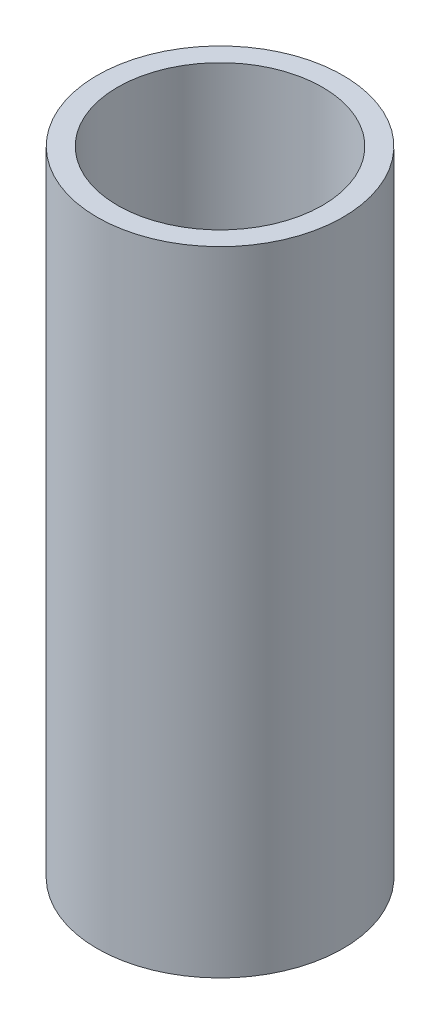
ISO-10303-21;
HEADER;
FILE_DESCRIPTION(('STEP AP214'),'2;1');
FILE_NAME('part.step','',(''),(''),'','','');
FILE_SCHEMA(('AUTOMOTIVE_DESIGN { 1 0 10303 214 1 1 1 1 }'));
ENDSEC;
DATA;
#1=APPLICATION_CONTEXT('core data for automotive mechanical design processes');
#2=APPLICATION_PROTOCOL_DEFINITION('international standard','automotive_design',2000,#1);
#3=PRODUCT_CONTEXT('',#1,'mechanical');
#4=PRODUCT('Part','Part','',(#3));
#5=PRODUCT_RELATED_PRODUCT_CATEGORY('part','',(#4));
#6=PRODUCT_DEFINITION_FORMATION('','',#4);
#7=PRODUCT_DEFINITION_CONTEXT('part definition',#1,'design');
#8=PRODUCT_DEFINITION('design','',#6,#7);
#9=PRODUCT_DEFINITION_SHAPE('','',#8);
#10=(LENGTH_UNIT() NAMED_UNIT(*) SI_UNIT(.MILLI.,.METRE.));
#11=(NAMED_UNIT(*) PLANE_ANGLE_UNIT() SI_UNIT($,.RADIAN.));
#12=(NAMED_UNIT(*) SI_UNIT($,.STERADIAN.) SOLID_ANGLE_UNIT());
#13=UNCERTAINTY_MEASURE_WITH_UNIT(LENGTH_MEASURE(1.E-05),#10,'distance_accuracy_value','');
#14=(GEOMETRIC_REPRESENTATION_CONTEXT(3) GLOBAL_UNCERTAINTY_ASSIGNED_CONTEXT((#13)) GLOBAL_UNIT_ASSIGNED_CONTEXT((#10,
#11,#12)) REPRESENTATION_CONTEXT('',''));
#15=CARTESIAN_POINT('',(0.,0.,0.));
#16=DIRECTION('',(0.,0.,1.));
#17=DIRECTION('',(1.,0.,0.));
#18=AXIS2_PLACEMENT_3D('',#15,#16,#17);
#19=CARTESIAN_POINT('',(0.,5.024,0.));
#20=DIRECTION('',(0.,1.,0.));
#21=DIRECTION('',(0.,0.,1.));
#22=AXIS2_PLACEMENT_3D('',#19,#20,#21);
#23=PLANE('',#22);
#24=CARTESIAN_POINT('',(0.,5.024,0.));
#25=DIRECTION('',(0.,1.,0.));
#26=DIRECTION('',(0.,0.,1.));
#27=AXIS2_PLACEMENT_3D('',#24,#25,#26);
#28=CIRCLE('',#27,1.95);
#29=CARTESIAN_POINT('',(0.,5.024,1.95));
#30=VERTEX_POINT('',#29);
#31=EDGE_CURVE('E10',#30,#30,#28,.T.);
#32=ORIENTED_EDGE('',*,*,#31,.T.);
#33=EDGE_LOOP('',(#32));
#34=FACE_BOUND('',#33,.T.);
#35=CARTESIAN_POINT('',(0.,5.024,0.));
#36=DIRECTION('',(0.,1.,0.));
#37=DIRECTION('',(0.,0.,1.));
#38=AXIS2_PLACEMENT_3D('',#35,#36,#37);
#39=CIRCLE('',#38,1.625);
#40=CARTESIAN_POINT('',(0.,5.024,1.625));
#41=VERTEX_POINT('',#40);
#42=EDGE_CURVE('E56',#41,#41,#39,.T.);
#43=ORIENTED_EDGE('',*,*,#42,.F.);
#44=EDGE_LOOP('',(#43));
#45=FACE_BOUND('',#44,.T.);
#46=ADVANCED_FACE('F43',(#34,#45),#23,.T.);
#47=CARTESIAN_POINT('',(0.,-5.024,0.));
#48=DIRECTION('',(0.,1.,0.));
#49=DIRECTION('',(0.,0.,1.));
#50=AXIS2_PLACEMENT_3D('',#47,#48,#49);
#51=PLANE('',#50);
#52=CARTESIAN_POINT('',(0.,-5.024,0.));
#53=DIRECTION('',(0.,1.,0.));
#54=DIRECTION('',(0.,0.,1.));
#55=AXIS2_PLACEMENT_3D('',#52,#53,#54);
#56=CIRCLE('',#55,1.95);
#57=CARTESIAN_POINT('',(0.,-5.024,1.95));
#58=VERTEX_POINT('',#57);
#59=EDGE_CURVE('E47',#58,#58,#56,.T.);
#60=ORIENTED_EDGE('',*,*,#59,.F.);
#61=EDGE_LOOP('',(#60));
#62=FACE_BOUND('',#61,.T.);
#63=CARTESIAN_POINT('',(0.,-5.024,0.));
#64=DIRECTION('',(0.,1.,0.));
#65=DIRECTION('',(0.,0.,1.));
#66=AXIS2_PLACEMENT_3D('',#63,#64,#65);
#67=CIRCLE('',#66,1.625);
#68=CARTESIAN_POINT('',(0.,-5.024,1.625));
#69=VERTEX_POINT('',#68);
#70=EDGE_CURVE('E58',#69,#69,#67,.T.);
#71=ORIENTED_EDGE('',*,*,#70,.T.);
#72=EDGE_LOOP('',(#71));
#73=FACE_BOUND('',#72,.T.);
#74=ADVANCED_FACE('F70',(#62,#73),#51,.F.);
#75=CARTESIAN_POINT('',(0.,5.024,0.));
#76=DIRECTION('',(0.,-1.,0.));
#77=DIRECTION('',(0.,0.,-1.));
#78=AXIS2_PLACEMENT_3D('',#75,#76,#77);
#79=CYLINDRICAL_SURFACE('',#78,1.95);
#80=ORIENTED_EDGE('',*,*,#31,.F.);
#81=EDGE_LOOP('',(#80));
#82=FACE_BOUND('',#81,.T.);
#83=ORIENTED_EDGE('',*,*,#59,.T.);
#84=EDGE_LOOP('',(#83));
#85=FACE_BOUND('',#84,.T.);
#86=ADVANCED_FACE('F45',(#82,#85),#79,.T.);
#87=CARTESIAN_POINT('',(0.,5.024,0.));
#88=DIRECTION('',(0.,-1.,0.));
#89=DIRECTION('',(0.,0.,-1.));
#90=AXIS2_PLACEMENT_3D('',#87,#88,#89);
#91=CYLINDRICAL_SURFACE('',#90,1.625);
#92=ORIENTED_EDGE('',*,*,#42,.T.);
#93=EDGE_LOOP('',(#92));
#94=FACE_BOUND('',#93,.T.);
#95=ORIENTED_EDGE('',*,*,#70,.F.);
#96=EDGE_LOOP('',(#95));
#97=FACE_BOUND('',#96,.T.);
#98=ADVANCED_FACE('F66',(#94,#97),#91,.F.);
#99=CLOSED_SHELL('',(#46,#74,#86,#98));
#100=MANIFOLD_SOLID_BREP('B2',#99);
#101=ADVANCED_BREP_SHAPE_REPRESENTATION('',(#18,#100),#14);
#102=SHAPE_DEFINITION_REPRESENTATION(#9,#101);
ENDSEC;
END-ISO-10303-21;
